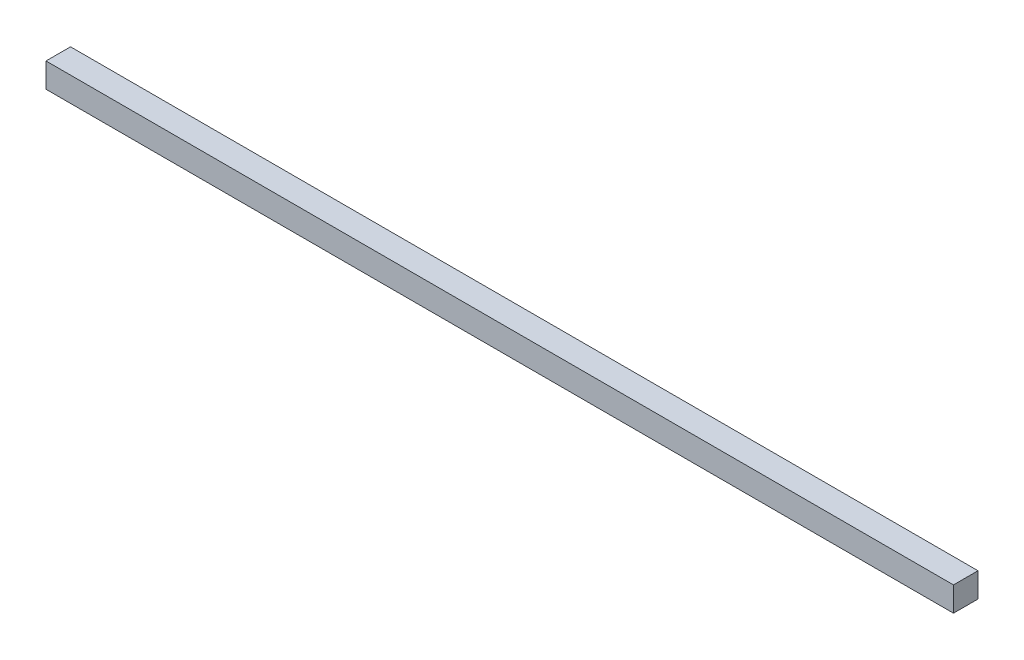
ISO-10303-21;
HEADER;
FILE_DESCRIPTION(('STEP AP214'),'2;1');
FILE_NAME('part.step','',(''),(''),'','','');
FILE_SCHEMA(('AUTOMOTIVE_DESIGN { 1 0 10303 214 1 1 1 1 }'));
ENDSEC;
DATA;
#1=APPLICATION_CONTEXT('core data for automotive mechanical design processes');
#2=APPLICATION_PROTOCOL_DEFINITION('international standard','automotive_design',2000,#1);
#3=PRODUCT_CONTEXT('',#1,'mechanical');
#4=PRODUCT('Part','Part','',(#3));
#5=PRODUCT_RELATED_PRODUCT_CATEGORY('part','',(#4));
#6=PRODUCT_DEFINITION_FORMATION('','',#4);
#7=PRODUCT_DEFINITION_CONTEXT('part definition',#1,'design');
#8=PRODUCT_DEFINITION('design','',#6,#7);
#9=PRODUCT_DEFINITION_SHAPE('','',#8);
#10=(LENGTH_UNIT() NAMED_UNIT(*) SI_UNIT(.MILLI.,.METRE.));
#11=(NAMED_UNIT(*) PLANE_ANGLE_UNIT() SI_UNIT($,.RADIAN.));
#12=(NAMED_UNIT(*) SI_UNIT($,.STERADIAN.) SOLID_ANGLE_UNIT());
#13=UNCERTAINTY_MEASURE_WITH_UNIT(LENGTH_MEASURE(1.E-05),#10,'distance_accuracy_value','');
#14=(GEOMETRIC_REPRESENTATION_CONTEXT(3) GLOBAL_UNCERTAINTY_ASSIGNED_CONTEXT((#13)) GLOBAL_UNIT_ASSIGNED_CONTEXT((#10,
#11,#12)) REPRESENTATION_CONTEXT('',''));
#15=CARTESIAN_POINT('',(0.,0.,0.));
#16=DIRECTION('',(0.,0.,1.));
#17=DIRECTION('',(1.,0.,0.));
#18=AXIS2_PLACEMENT_3D('',#15,#16,#17);
#19=CARTESIAN_POINT('',(939.8,0.,0.));
#20=DIRECTION('',(0.,0.,-1.));
#21=DIRECTION('',(-1.,0.,0.));
#22=AXIS2_PLACEMENT_3D('',#19,#20,#21);
#23=PLANE('',#22);
#24=DIRECTION('',(0.,-1.,0.));
#25=VECTOR('',#24,1.);
#26=CARTESIAN_POINT('',(0.,0.,0.));
#27=LINE('',#26,#25);
#28=CARTESIAN_POINT('',(0.,25.4,0.));
#29=VERTEX_POINT('',#28);
#30=CARTESIAN_POINT('',(0.,0.,0.));
#31=VERTEX_POINT('',#30);
#32=EDGE_CURVE('E96',#29,#31,#27,.T.);
#33=ORIENTED_EDGE('',*,*,#32,.T.);
#34=DIRECTION('',(-1.,0.,0.));
#35=VECTOR('',#34,1.);
#36=CARTESIAN_POINT('',(939.8,0.,0.));
#37=LINE('',#36,#35);
#38=CARTESIAN_POINT('',(939.8,0.,0.));
#39=VERTEX_POINT('',#38);
#40=EDGE_CURVE('E11',#39,#31,#37,.T.);
#41=ORIENTED_EDGE('',*,*,#40,.F.);
#42=DIRECTION('',(0.,-1.,0.));
#43=VECTOR('',#42,1.);
#44=CARTESIAN_POINT('',(939.8,0.,0.));
#45=LINE('',#44,#43);
#46=CARTESIAN_POINT('',(939.8,25.4,0.));
#47=VERTEX_POINT('',#46);
#48=EDGE_CURVE('E84',#47,#39,#45,.T.);
#49=ORIENTED_EDGE('',*,*,#48,.F.);
#50=DIRECTION('',(-1.,0.,0.));
#51=VECTOR('',#50,1.);
#52=CARTESIAN_POINT('',(939.8,25.4,0.));
#53=LINE('',#52,#51);
#54=EDGE_CURVE('E92',#47,#29,#53,.T.);
#55=ORIENTED_EDGE('',*,*,#54,.T.);
#56=EDGE_LOOP('',(#33,#41,#49,#55));
#57=FACE_BOUND('',#56,.T.);
#58=ADVANCED_FACE('F33',(#57),#23,.F.);
#59=CARTESIAN_POINT('',(939.8,0.,0.));
#60=DIRECTION('',(0.,1.,0.));
#61=DIRECTION('',(0.,0.,1.));
#62=AXIS2_PLACEMENT_3D('',#59,#60,#61);
#63=PLANE('',#62);
#64=DIRECTION('',(0.,0.,-1.));
#65=VECTOR('',#64,1.);
#66=CARTESIAN_POINT('',(0.,0.,0.));
#67=LINE('',#66,#65);
#68=CARTESIAN_POINT('',(0.,0.,-25.4));
#69=VERTEX_POINT('',#68);
#70=EDGE_CURVE('E88',#31,#69,#67,.T.);
#71=ORIENTED_EDGE('',*,*,#70,.T.);
#72=DIRECTION('',(-1.,0.,0.));
#73=VECTOR('',#72,1.);
#74=CARTESIAN_POINT('',(939.8,0.,-25.4));
#75=LINE('',#74,#73);
#76=CARTESIAN_POINT('',(939.8,0.,-25.4));
#77=VERTEX_POINT('',#76);
#78=EDGE_CURVE('E41',#77,#69,#75,.T.);
#79=ORIENTED_EDGE('',*,*,#78,.F.);
#80=DIRECTION('',(0.,0.,-1.));
#81=VECTOR('',#80,1.);
#82=CARTESIAN_POINT('',(939.8,0.,0.));
#83=LINE('',#82,#81);
#84=EDGE_CURVE('E79',#39,#77,#83,.T.);
#85=ORIENTED_EDGE('',*,*,#84,.F.);
#86=ORIENTED_EDGE('',*,*,#40,.T.);
#87=EDGE_LOOP('',(#71,#79,#85,#86));
#88=FACE_BOUND('',#87,.T.);
#89=ADVANCED_FACE('F87',(#88),#63,.F.);
#90=CARTESIAN_POINT('',(939.8,0.,-25.4));
#91=DIRECTION('',(0.,0.,1.));
#92=DIRECTION('',(1.,0.,0.));
#93=AXIS2_PLACEMENT_3D('',#90,#91,#92);
#94=PLANE('',#93);
#95=DIRECTION('',(0.,1.,0.));
#96=VECTOR('',#95,1.);
#97=CARTESIAN_POINT('',(0.,0.,-25.4));
#98=LINE('',#97,#96);
#99=CARTESIAN_POINT('',(0.,25.4,-25.4));
#100=VERTEX_POINT('',#99);
#101=EDGE_CURVE('E66',#69,#100,#98,.T.);
#102=ORIENTED_EDGE('',*,*,#101,.T.);
#103=DIRECTION('',(-1.,0.,0.));
#104=VECTOR('',#103,1.);
#105=CARTESIAN_POINT('',(939.8,25.4,-25.4));
#106=LINE('',#105,#104);
#107=CARTESIAN_POINT('',(939.8,25.4,-25.4));
#108=VERTEX_POINT('',#107);
#109=EDGE_CURVE('E89',#108,#100,#106,.T.);
#110=ORIENTED_EDGE('',*,*,#109,.F.);
#111=DIRECTION('',(0.,1.,0.));
#112=VECTOR('',#111,1.);
#113=CARTESIAN_POINT('',(939.8,0.,-25.4));
#114=LINE('',#113,#112);
#115=EDGE_CURVE('E82',#77,#108,#114,.T.);
#116=ORIENTED_EDGE('',*,*,#115,.F.);
#117=ORIENTED_EDGE('',*,*,#78,.T.);
#118=EDGE_LOOP('',(#102,#110,#116,#117));
#119=FACE_BOUND('',#118,.T.);
#120=ADVANCED_FACE('F90',(#119),#94,.F.);
#121=CARTESIAN_POINT('',(939.8,25.4,0.));
#122=DIRECTION('',(0.,-1.,0.));
#123=DIRECTION('',(0.,0.,-1.));
#124=AXIS2_PLACEMENT_3D('',#121,#122,#123);
#125=PLANE('',#124);
#126=DIRECTION('',(0.,0.,1.));
#127=VECTOR('',#126,1.);
#128=CARTESIAN_POINT('',(0.,25.4,0.));
#129=LINE('',#128,#127);
#130=EDGE_CURVE('E72',#100,#29,#129,.T.);
#131=ORIENTED_EDGE('',*,*,#130,.T.);
#132=ORIENTED_EDGE('',*,*,#54,.F.);
#133=DIRECTION('',(0.,0.,1.));
#134=VECTOR('',#133,1.);
#135=CARTESIAN_POINT('',(939.8,25.4,0.));
#136=LINE('',#135,#134);
#137=EDGE_CURVE('E49',#108,#47,#136,.T.);
#138=ORIENTED_EDGE('',*,*,#137,.F.);
#139=ORIENTED_EDGE('',*,*,#109,.T.);
#140=EDGE_LOOP('',(#131,#132,#138,#139));
#141=FACE_BOUND('',#140,.T.);
#142=ADVANCED_FACE('F103',(#141),#125,.F.);
#143=CARTESIAN_POINT('',(939.8,0.,0.));
#144=DIRECTION('',(-1.,0.,0.));
#145=DIRECTION('',(0.,0.,1.));
#146=AXIS2_PLACEMENT_3D('',#143,#144,#145);
#147=PLANE('',#146);
#148=ORIENTED_EDGE('',*,*,#48,.T.);
#149=ORIENTED_EDGE('',*,*,#84,.T.);
#150=ORIENTED_EDGE('',*,*,#115,.T.);
#151=ORIENTED_EDGE('',*,*,#137,.T.);
#152=EDGE_LOOP('',(#148,#149,#150,#151));
#153=FACE_BOUND('',#152,.T.);
#154=ADVANCED_FACE('F80',(#153),#147,.F.);
#155=CARTESIAN_POINT('',(0.,0.,0.));
#156=DIRECTION('',(-1.,0.,0.));
#157=DIRECTION('',(0.,0.,1.));
#158=AXIS2_PLACEMENT_3D('',#155,#156,#157);
#159=PLANE('',#158);
#160=ORIENTED_EDGE('',*,*,#32,.F.);
#161=ORIENTED_EDGE('',*,*,#130,.F.);
#162=ORIENTED_EDGE('',*,*,#101,.F.);
#163=ORIENTED_EDGE('',*,*,#70,.F.);
#164=EDGE_LOOP('',(#160,#161,#162,#163));
#165=FACE_BOUND('',#164,.T.);
#166=ADVANCED_FACE('F106',(#165),#159,.T.);
#167=CLOSED_SHELL('',(#58,#89,#120,#142,#154,#166));
#168=MANIFOLD_SOLID_BREP('B2',#167);
#169=ADVANCED_BREP_SHAPE_REPRESENTATION('',(#18,#168),#14);
#170=SHAPE_DEFINITION_REPRESENTATION(#9,#169);
ENDSEC;
END-ISO-10303-21;
